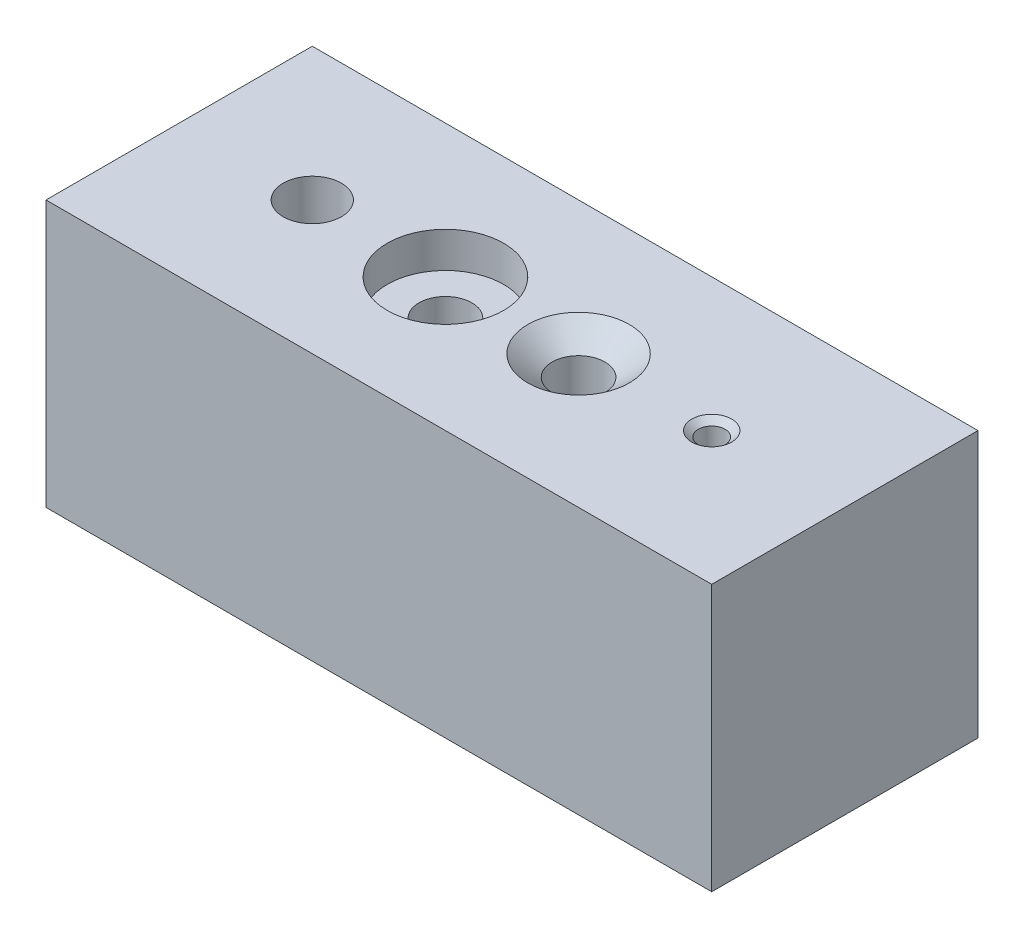
ISO-10303-21;
HEADER;
FILE_DESCRIPTION(('STEP AP214'),'2;1');
FILE_NAME('part.step','',(''),(''),'','','');
FILE_SCHEMA(('AUTOMOTIVE_DESIGN { 1 0 10303 214 1 1 1 1 }'));
ENDSEC;
DATA;
#1=APPLICATION_CONTEXT('core data for automotive mechanical design processes');
#2=APPLICATION_PROTOCOL_DEFINITION('international standard','automotive_design',2000,#1);
#3=PRODUCT_CONTEXT('',#1,'mechanical');
#4=PRODUCT('Part','Part','',(#3));
#5=PRODUCT_RELATED_PRODUCT_CATEGORY('part','',(#4));
#6=PRODUCT_DEFINITION_FORMATION('','',#4);
#7=PRODUCT_DEFINITION_CONTEXT('part definition',#1,'design');
#8=PRODUCT_DEFINITION('design','',#6,#7);
#9=PRODUCT_DEFINITION_SHAPE('','',#8);
#10=(LENGTH_UNIT() NAMED_UNIT(*) SI_UNIT(.MILLI.,.METRE.));
#11=(NAMED_UNIT(*) PLANE_ANGLE_UNIT() SI_UNIT($,.RADIAN.));
#12=(NAMED_UNIT(*) SI_UNIT($,.STERADIAN.) SOLID_ANGLE_UNIT());
#13=UNCERTAINTY_MEASURE_WITH_UNIT(LENGTH_MEASURE(1.E-05),#10,'distance_accuracy_value','');
#14=(GEOMETRIC_REPRESENTATION_CONTEXT(3) GLOBAL_UNCERTAINTY_ASSIGNED_CONTEXT((#13)) GLOBAL_UNIT_ASSIGNED_CONTEXT((#10,
#11,#12)) REPRESENTATION_CONTEXT('',''));
#15=CARTESIAN_POINT('',(0.,0.,0.));
#16=DIRECTION('',(0.,0.,1.));
#17=DIRECTION('',(1.,0.,0.));
#18=AXIS2_PLACEMENT_3D('',#15,#16,#17);
#19=CARTESIAN_POINT('',(63.5,-25.4,50.8));
#20=DIRECTION('',(-1.,0.,0.));
#21=DIRECTION('',(0.,0.,1.));
#22=AXIS2_PLACEMENT_3D('',#19,#20,#21);
#23=PLANE('',#22);
#24=DIRECTION('',(0.,1.,0.));
#25=VECTOR('',#24,1.);
#26=CARTESIAN_POINT('',(63.5,-25.4,0.));
#27=LINE('',#26,#25);
#28=CARTESIAN_POINT('',(63.5,-25.4,0.));
#29=VERTEX_POINT('',#28);
#30=CARTESIAN_POINT('',(63.5,25.4,0.));
#31=VERTEX_POINT('',#30);
#32=EDGE_CURVE('E142',#29,#31,#27,.T.);
#33=ORIENTED_EDGE('',*,*,#32,.T.);
#34=DIRECTION('',(0.,0.,-1.));
#35=VECTOR('',#34,1.);
#36=CARTESIAN_POINT('',(63.5,25.4,50.8));
#37=LINE('',#36,#35);
#38=CARTESIAN_POINT('',(63.5,25.4,50.8));
#39=VERTEX_POINT('',#38);
#40=EDGE_CURVE('E11',#39,#31,#37,.T.);
#41=ORIENTED_EDGE('',*,*,#40,.F.);
#42=DIRECTION('',(0.,1.,0.));
#43=VECTOR('',#42,1.);
#44=CARTESIAN_POINT('',(63.5,-25.4,50.8));
#45=LINE('',#44,#43);
#46=CARTESIAN_POINT('',(63.5,-25.4,50.8));
#47=VERTEX_POINT('',#46);
#48=EDGE_CURVE('E143',#47,#39,#45,.T.);
#49=ORIENTED_EDGE('',*,*,#48,.F.);
#50=DIRECTION('',(0.,0.,-1.));
#51=VECTOR('',#50,1.);
#52=CARTESIAN_POINT('',(63.5,-25.4,50.8));
#53=LINE('',#52,#51);
#54=EDGE_CURVE('E149',#47,#29,#53,.T.);
#55=ORIENTED_EDGE('',*,*,#54,.T.);
#56=EDGE_LOOP('',(#33,#41,#49,#55));
#57=FACE_BOUND('',#56,.T.);
#58=ADVANCED_FACE('F41',(#57),#23,.F.);
#59=CARTESIAN_POINT('',(-63.5,25.4,50.8));
#60=DIRECTION('',(0.,-1.,0.));
#61=DIRECTION('',(0.,0.,-1.));
#62=AXIS2_PLACEMENT_3D('',#59,#60,#61);
#63=PLANE('',#62);
#64=CARTESIAN_POINT('',(38.1,25.4,25.4));
#65=DIRECTION('',(0.,1.,0.));
#66=DIRECTION('',(0.,0.,1.));
#67=AXIS2_PLACEMENT_3D('',#64,#65,#66);
#68=CIRCLE('',#67,3.81);
#69=CARTESIAN_POINT('',(38.1,25.4,29.21));
#70=VERTEX_POINT('',#69);
#71=EDGE_CURVE('E115',#70,#70,#68,.T.);
#72=ORIENTED_EDGE('',*,*,#71,.F.);
#73=EDGE_LOOP('',(#72));
#74=FACE_BOUND('',#73,.T.);
#75=CARTESIAN_POINT('',(12.7,25.4,25.4));
#76=DIRECTION('',(0.,1.,0.));
#77=DIRECTION('',(0.,0.,1.));
#78=AXIS2_PLACEMENT_3D('',#75,#76,#77);
#79=CIRCLE('',#78,9.6774);
#80=CARTESIAN_POINT('',(12.7,25.4,35.0774));
#81=VERTEX_POINT('',#80);
#82=EDGE_CURVE('E108',#81,#81,#79,.T.);
#83=ORIENTED_EDGE('',*,*,#82,.F.);
#84=EDGE_LOOP('',(#83));
#85=FACE_BOUND('',#84,.T.);
#86=CARTESIAN_POINT('',(-12.7,25.4,25.4));
#87=DIRECTION('',(0.,1.,0.));
#88=DIRECTION('',(0.,0.,1.));
#89=AXIS2_PLACEMENT_3D('',#86,#87,#88);
#90=CIRCLE('',#89,11.1125);
#91=CARTESIAN_POINT('',(-12.7,25.4,36.5125));
#92=VERTEX_POINT('',#91);
#93=EDGE_CURVE('E124',#92,#92,#90,.T.);
#94=ORIENTED_EDGE('',*,*,#93,.F.);
#95=EDGE_LOOP('',(#94));
#96=FACE_BOUND('',#95,.T.);
#97=CARTESIAN_POINT('',(-38.1,25.4,25.4));
#98=DIRECTION('',(0.,1.,0.));
#99=DIRECTION('',(0.,0.,1.));
#100=AXIS2_PLACEMENT_3D('',#97,#98,#99);
#101=CIRCLE('',#100,5.55624999999998);
#102=CARTESIAN_POINT('',(-38.1,25.4,30.95625));
#103=VERTEX_POINT('',#102);
#104=EDGE_CURVE('E136',#103,#103,#101,.T.);
#105=ORIENTED_EDGE('',*,*,#104,.F.);
#106=EDGE_LOOP('',(#105));
#107=FACE_BOUND('',#106,.T.);
#108=DIRECTION('',(-1.,0.,0.));
#109=VECTOR('',#108,1.);
#110=CARTESIAN_POINT('',(-63.5,25.4,0.));
#111=LINE('',#110,#109);
#112=CARTESIAN_POINT('',(-63.5,25.4,0.));
#113=VERTEX_POINT('',#112);
#114=EDGE_CURVE('E152',#31,#113,#111,.T.);
#115=ORIENTED_EDGE('',*,*,#114,.T.);
#116=DIRECTION('',(0.,0.,-1.));
#117=VECTOR('',#116,1.);
#118=CARTESIAN_POINT('',(-63.5,25.4,50.8));
#119=LINE('',#118,#117);
#120=CARTESIAN_POINT('',(-63.5,25.4,50.8));
#121=VERTEX_POINT('',#120);
#122=EDGE_CURVE('E49',#121,#113,#119,.T.);
#123=ORIENTED_EDGE('',*,*,#122,.F.);
#124=DIRECTION('',(-1.,0.,0.));
#125=VECTOR('',#124,1.);
#126=CARTESIAN_POINT('',(-63.5,25.4,50.8));
#127=LINE('',#126,#125);
#128=EDGE_CURVE('E88',#39,#121,#127,.T.);
#129=ORIENTED_EDGE('',*,*,#128,.F.);
#130=ORIENTED_EDGE('',*,*,#40,.T.);
#131=EDGE_LOOP('',(#115,#123,#129,#130));
#132=FACE_BOUND('',#131,.T.);
#133=ADVANCED_FACE('F176',(#74,#85,#96,#107,#132),#63,.F.);
#134=CARTESIAN_POINT('',(-63.5,-25.4,50.8));
#135=DIRECTION('',(1.,0.,0.));
#136=DIRECTION('',(0.,0.,-1.));
#137=AXIS2_PLACEMENT_3D('',#134,#135,#136);
#138=PLANE('',#137);
#139=DIRECTION('',(0.,-1.,0.));
#140=VECTOR('',#139,1.);
#141=CARTESIAN_POINT('',(-63.5,-25.4,0.));
#142=LINE('',#141,#140);
#143=CARTESIAN_POINT('',(-63.5,-25.4,0.));
#144=VERTEX_POINT('',#143);
#145=EDGE_CURVE('E75',#113,#144,#142,.T.);
#146=ORIENTED_EDGE('',*,*,#145,.T.);
#147=DIRECTION('',(0.,0.,-1.));
#148=VECTOR('',#147,1.);
#149=CARTESIAN_POINT('',(-63.5,-25.4,50.8));
#150=LINE('',#149,#148);
#151=CARTESIAN_POINT('',(-63.5,-25.4,50.8));
#152=VERTEX_POINT('',#151);
#153=EDGE_CURVE('E157',#152,#144,#150,.T.);
#154=ORIENTED_EDGE('',*,*,#153,.F.);
#155=DIRECTION('',(0.,-1.,0.));
#156=VECTOR('',#155,1.);
#157=CARTESIAN_POINT('',(-63.5,-25.4,50.8));
#158=LINE('',#157,#156);
#159=EDGE_CURVE('E146',#121,#152,#158,.T.);
#160=ORIENTED_EDGE('',*,*,#159,.F.);
#161=ORIENTED_EDGE('',*,*,#122,.T.);
#162=EDGE_LOOP('',(#146,#154,#160,#161));
#163=FACE_BOUND('',#162,.T.);
#164=ADVANCED_FACE('F159',(#163),#138,.F.);
#165=CARTESIAN_POINT('',(-63.5,-25.4,50.8));
#166=DIRECTION('',(0.,1.,0.));
#167=DIRECTION('',(0.,0.,1.));
#168=AXIS2_PLACEMENT_3D('',#165,#166,#167);
#169=PLANE('',#168);
#170=CARTESIAN_POINT('',(-12.7,-25.4,25.4));
#171=DIRECTION('',(0.,1.,0.));
#172=DIRECTION('',(0.,0.,1.));
#173=AXIS2_PLACEMENT_3D('',#170,#171,#172);
#174=CIRCLE('',#173,5.04189999999998);
#175=CARTESIAN_POINT('',(-12.7,-25.4,30.4419));
#176=VERTEX_POINT('',#175);
#177=EDGE_CURVE('E133',#176,#176,#174,.T.);
#178=ORIENTED_EDGE('',*,*,#177,.T.);
#179=EDGE_LOOP('',(#178));
#180=FACE_BOUND('',#179,.T.);
#181=DIRECTION('',(1.,0.,0.));
#182=VECTOR('',#181,1.);
#183=CARTESIAN_POINT('',(-63.5,-25.4,0.));
#184=LINE('',#183,#182);
#185=EDGE_CURVE('E81',#144,#29,#184,.T.);
#186=ORIENTED_EDGE('',*,*,#185,.T.);
#187=ORIENTED_EDGE('',*,*,#54,.F.);
#188=DIRECTION('',(1.,0.,0.));
#189=VECTOR('',#188,1.);
#190=CARTESIAN_POINT('',(-63.5,-25.4,50.8));
#191=LINE('',#190,#189);
#192=EDGE_CURVE('E57',#152,#47,#191,.T.);
#193=ORIENTED_EDGE('',*,*,#192,.F.);
#194=ORIENTED_EDGE('',*,*,#153,.T.);
#195=EDGE_LOOP('',(#186,#187,#193,#194));
#196=FACE_BOUND('',#195,.T.);
#197=ADVANCED_FACE('F166',(#180,#196),#169,.F.);
#198=CARTESIAN_POINT('',(0.,0.,50.8));
#199=DIRECTION('',(0.,0.,-1.));
#200=DIRECTION('',(-1.,0.,0.));
#201=AXIS2_PLACEMENT_3D('',#198,#199,#200);
#202=PLANE('',#201);
#203=ORIENTED_EDGE('',*,*,#48,.T.);
#204=ORIENTED_EDGE('',*,*,#128,.T.);
#205=ORIENTED_EDGE('',*,*,#159,.T.);
#206=ORIENTED_EDGE('',*,*,#192,.T.);
#207=EDGE_LOOP('',(#203,#204,#205,#206));
#208=FACE_BOUND('',#207,.T.);
#209=ADVANCED_FACE('F168',(#208),#202,.F.);
#210=CARTESIAN_POINT('',(0.,0.,0.));
#211=DIRECTION('',(0.,0.,-1.));
#212=DIRECTION('',(-1.,0.,0.));
#213=AXIS2_PLACEMENT_3D('',#210,#211,#212);
#214=PLANE('',#213);
#215=ORIENTED_EDGE('',*,*,#32,.F.);
#216=ORIENTED_EDGE('',*,*,#185,.F.);
#217=ORIENTED_EDGE('',*,*,#145,.F.);
#218=ORIENTED_EDGE('',*,*,#114,.F.);
#219=EDGE_LOOP('',(#215,#216,#217,#218));
#220=FACE_BOUND('',#219,.T.);
#221=ADVANCED_FACE('F162',(#220),#214,.T.);
#222=CARTESIAN_POINT('',(-38.1,6.35,25.4));
#223=DIRECTION('',(0.,1.,0.));
#224=DIRECTION('',(0.,0.,1.));
#225=AXIS2_PLACEMENT_3D('',#222,#223,#224);
#226=CONICAL_SURFACE('',#225,5.55624999999998,1.02974425867665);
#227=CARTESIAN_POINT('',(-38.1,3.01146818552812,25.4));
#228=VERTEX_POINT('',#227);
#229=VERTEX_LOOP('',#228);
#230=FACE_BOUND('',#229,.T.);
#231=CARTESIAN_POINT('',(-38.1,6.35,25.4));
#232=DIRECTION('',(0.,1.,0.));
#233=DIRECTION('',(0.,0.,1.));
#234=AXIS2_PLACEMENT_3D('',#231,#232,#233);
#235=CIRCLE('',#234,5.55624999999998);
#236=CARTESIAN_POINT('',(-38.1,6.35,30.95625));
#237=VERTEX_POINT('',#236);
#238=EDGE_CURVE('E139',#237,#237,#235,.T.);
#239=ORIENTED_EDGE('',*,*,#238,.T.);
#240=EDGE_LOOP('',(#239));
#241=FACE_BOUND('',#240,.T.);
#242=ADVANCED_FACE('F198',(#230,#241),#226,.F.);
#243=CARTESIAN_POINT('',(-38.1,25.4,25.4));
#244=DIRECTION('',(0.,1.,0.));
#245=DIRECTION('',(0.,0.,1.));
#246=AXIS2_PLACEMENT_3D('',#243,#244,#245);
#247=CYLINDRICAL_SURFACE('',#246,5.55624999999998);
#248=ORIENTED_EDGE('',*,*,#238,.F.);
#249=EDGE_LOOP('',(#248));
#250=FACE_BOUND('',#249,.T.);
#251=ORIENTED_EDGE('',*,*,#104,.T.);
#252=EDGE_LOOP('',(#251));
#253=FACE_BOUND('',#252,.T.);
#254=ADVANCED_FACE('F195',(#250,#253),#247,.F.);
#255=CARTESIAN_POINT('',(-12.7,25.4,25.4));
#256=DIRECTION('',(0.,1.,0.));
#257=DIRECTION('',(0.,0.,1.));
#258=AXIS2_PLACEMENT_3D('',#255,#256,#257);
#259=CYLINDRICAL_SURFACE('',#258,5.04189999999999);
#260=ORIENTED_EDGE('',*,*,#177,.F.);
#261=EDGE_LOOP('',(#260));
#262=FACE_BOUND('',#261,.T.);
#263=CARTESIAN_POINT('',(-12.7,18.5928,25.4));
#264=DIRECTION('',(0.,1.,0.));
#265=DIRECTION('',(0.,0.,1.));
#266=AXIS2_PLACEMENT_3D('',#263,#264,#265);
#267=CIRCLE('',#266,5.0419);
#268=CARTESIAN_POINT('',(-12.7,18.5928,30.4419));
#269=VERTEX_POINT('',#268);
#270=EDGE_CURVE('E130',#269,#269,#267,.T.);
#271=ORIENTED_EDGE('',*,*,#270,.T.);
#272=EDGE_LOOP('',(#271));
#273=FACE_BOUND('',#272,.T.);
#274=ADVANCED_FACE('F197',(#262,#273),#259,.F.);
#275=CARTESIAN_POINT('',(-7.6581,18.5928,25.4));
#276=DIRECTION('',(0.,-1.,0.));
#277=DIRECTION('',(0.,0.,-1.));
#278=AXIS2_PLACEMENT_3D('',#275,#276,#277);
#279=PLANE('',#278);
#280=ORIENTED_EDGE('',*,*,#270,.F.);
#281=EDGE_LOOP('',(#280));
#282=FACE_BOUND('',#281,.T.);
#283=CARTESIAN_POINT('',(-12.7,18.5928,25.4));
#284=DIRECTION('',(0.,1.,0.));
#285=DIRECTION('',(0.,0.,1.));
#286=AXIS2_PLACEMENT_3D('',#283,#284,#285);
#287=CIRCLE('',#286,11.1125);
#288=CARTESIAN_POINT('',(-12.7,18.5928,36.5125));
#289=VERTEX_POINT('',#288);
#290=EDGE_CURVE('E127',#289,#289,#287,.T.);
#291=ORIENTED_EDGE('',*,*,#290,.T.);
#292=EDGE_LOOP('',(#291));
#293=FACE_BOUND('',#292,.T.);
#294=ADVANCED_FACE('F205',(#282,#293),#279,.F.);
#295=CARTESIAN_POINT('',(-12.7,25.4,25.4));
#296=DIRECTION('',(0.,1.,0.));
#297=DIRECTION('',(0.,0.,1.));
#298=AXIS2_PLACEMENT_3D('',#295,#296,#297);
#299=CYLINDRICAL_SURFACE('',#298,11.1125);
#300=ORIENTED_EDGE('',*,*,#290,.F.);
#301=EDGE_LOOP('',(#300));
#302=FACE_BOUND('',#301,.T.);
#303=ORIENTED_EDGE('',*,*,#93,.T.);
#304=EDGE_LOOP('',(#303));
#305=FACE_BOUND('',#304,.T.);
#306=ADVANCED_FACE('F246',(#302,#305),#299,.F.);
#307=CARTESIAN_POINT('',(12.7,-12.7,25.4));
#308=DIRECTION('',(0.,1.,0.));
#309=DIRECTION('',(0.,0.,1.));
#310=AXIS2_PLACEMENT_3D('',#307,#308,#309);
#311=CONICAL_SURFACE('',#310,5.04189999999999,1.02974425867665);
#312=CARTESIAN_POINT('',(12.7,-15.7294791550751,25.4));
#313=VERTEX_POINT('',#312);
#314=VERTEX_LOOP('',#313);
#315=FACE_BOUND('',#314,.T.);
#316=CARTESIAN_POINT('',(12.7,-12.7,25.4));
#317=DIRECTION('',(0.,1.,0.));
#318=DIRECTION('',(0.,0.,1.));
#319=AXIS2_PLACEMENT_3D('',#316,#317,#318);
#320=CIRCLE('',#319,5.04189999999999);
#321=CARTESIAN_POINT('',(12.7,-12.7,30.4419));
#322=VERTEX_POINT('',#321);
#323=EDGE_CURVE('E121',#322,#322,#320,.T.);
#324=ORIENTED_EDGE('',*,*,#323,.T.);
#325=EDGE_LOOP('',(#324));
#326=FACE_BOUND('',#325,.T.);
#327=ADVANCED_FACE('F255',(#315,#326),#311,.F.);
#328=CARTESIAN_POINT('',(12.7,25.4,25.4));
#329=DIRECTION('',(0.,1.,0.));
#330=DIRECTION('',(0.,0.,1.));
#331=AXIS2_PLACEMENT_3D('',#328,#329,#330);
#332=CYLINDRICAL_SURFACE('',#331,5.0419);
#333=ORIENTED_EDGE('',*,*,#323,.F.);
#334=EDGE_LOOP('',(#333));
#335=FACE_BOUND('',#334,.T.);
#336=CARTESIAN_POINT('',(12.7,21.5103536596777,25.4));
#337=DIRECTION('',(0.,1.,0.));
#338=DIRECTION('',(0.,0.,1.));
#339=AXIS2_PLACEMENT_3D('',#336,#337,#338);
#340=CIRCLE('',#339,5.0419);
#341=CARTESIAN_POINT('',(12.7,21.5103536596777,30.4419));
#342=VERTEX_POINT('',#341);
#343=EDGE_CURVE('E112',#342,#342,#340,.T.);
#344=ORIENTED_EDGE('',*,*,#343,.T.);
#345=EDGE_LOOP('',(#344));
#346=FACE_BOUND('',#345,.T.);
#347=ADVANCED_FACE('F265',(#335,#346),#332,.F.);
#348=CARTESIAN_POINT('',(12.7,25.4,25.4));
#349=DIRECTION('',(0.,1.,0.));
#350=DIRECTION('',(0.,0.,1.));
#351=AXIS2_PLACEMENT_3D('',#348,#349,#350);
#352=CONICAL_SURFACE('',#351,9.6774,0.872664625997165);
#353=ORIENTED_EDGE('',*,*,#343,.F.);
#354=EDGE_LOOP('',(#353));
#355=FACE_BOUND('',#354,.T.);
#356=ORIENTED_EDGE('',*,*,#82,.T.);
#357=EDGE_LOOP('',(#356));
#358=FACE_BOUND('',#357,.T.);
#359=ADVANCED_FACE('F102',(#355,#358),#352,.F.);
#360=CARTESIAN_POINT('',(38.1,0.,25.4));
#361=DIRECTION('',(0.,1.,0.));
#362=DIRECTION('',(0.,0.,1.));
#363=AXIS2_PLACEMENT_3D('',#360,#361,#362);
#364=CONICAL_SURFACE('',#363,2.5527,1.02974425867665);
#365=CARTESIAN_POINT('',(38.1,-1.53381690219166,25.4));
#366=VERTEX_POINT('',#365);
#367=VERTEX_LOOP('',#366);
#368=FACE_BOUND('',#367,.T.);
#369=CARTESIAN_POINT('',(38.1,0.,25.4));
#370=DIRECTION('',(0.,1.,0.));
#371=DIRECTION('',(0.,0.,1.));
#372=AXIS2_PLACEMENT_3D('',#369,#370,#371);
#373=CIRCLE('',#372,2.5527);
#374=CARTESIAN_POINT('',(38.1,0.,27.9527));
#375=VERTEX_POINT('',#374);
#376=EDGE_CURVE('E106',#375,#375,#373,.T.);
#377=ORIENTED_EDGE('',*,*,#376,.T.);
#378=EDGE_LOOP('',(#377));
#379=FACE_BOUND('',#378,.T.);
#380=ADVANCED_FACE('F98',(#368,#379),#364,.F.);
#381=CARTESIAN_POINT('',(38.1,25.4,25.4));
#382=DIRECTION('',(0.,1.,0.));
#383=DIRECTION('',(0.,0.,1.));
#384=AXIS2_PLACEMENT_3D('',#381,#382,#383);
#385=CYLINDRICAL_SURFACE('',#384,2.5527);
#386=ORIENTED_EDGE('',*,*,#376,.F.);
#387=EDGE_LOOP('',(#386));
#388=FACE_BOUND('',#387,.T.);
#389=CARTESIAN_POINT('',(38.1,24.3450000337208,25.4));
#390=DIRECTION('',(0.,1.,0.));
#391=DIRECTION('',(0.,0.,1.));
#392=AXIS2_PLACEMENT_3D('',#389,#390,#391);
#393=CIRCLE('',#392,2.5527);
#394=CARTESIAN_POINT('',(38.1,24.3450000337208,27.9527));
#395=VERTEX_POINT('',#394);
#396=EDGE_CURVE('E109',#395,#395,#393,.T.);
#397=ORIENTED_EDGE('',*,*,#396,.T.);
#398=EDGE_LOOP('',(#397));
#399=FACE_BOUND('',#398,.T.);
#400=ADVANCED_FACE('F101',(#388,#399),#385,.F.);
#401=CARTESIAN_POINT('',(38.1,25.4,25.4));
#402=DIRECTION('',(0.,1.,0.));
#403=DIRECTION('',(0.,0.,1.));
#404=AXIS2_PLACEMENT_3D('',#401,#402,#403);
#405=CONICAL_SURFACE('',#404,3.81,0.872664625997165);
#406=ORIENTED_EDGE('',*,*,#396,.F.);
#407=EDGE_LOOP('',(#406));
#408=FACE_BOUND('',#407,.T.);
#409=ORIENTED_EDGE('',*,*,#71,.T.);
#410=EDGE_LOOP('',(#409));
#411=FACE_BOUND('',#410,.T.);
#412=ADVANCED_FACE('F305',(#408,#411),#405,.F.);
#413=CLOSED_SHELL('',(#58,#133,#164,#197,#209,#221,#242,#254,#274,#294,#306,#327,#347,#359,#380,
#400,#412));
#414=MANIFOLD_SOLID_BREP('B2',#413);
#415=ADVANCED_BREP_SHAPE_REPRESENTATION('',(#18,#414),#14);
#416=SHAPE_DEFINITION_REPRESENTATION(#9,#415);
ENDSEC;
END-ISO-10303-21;
